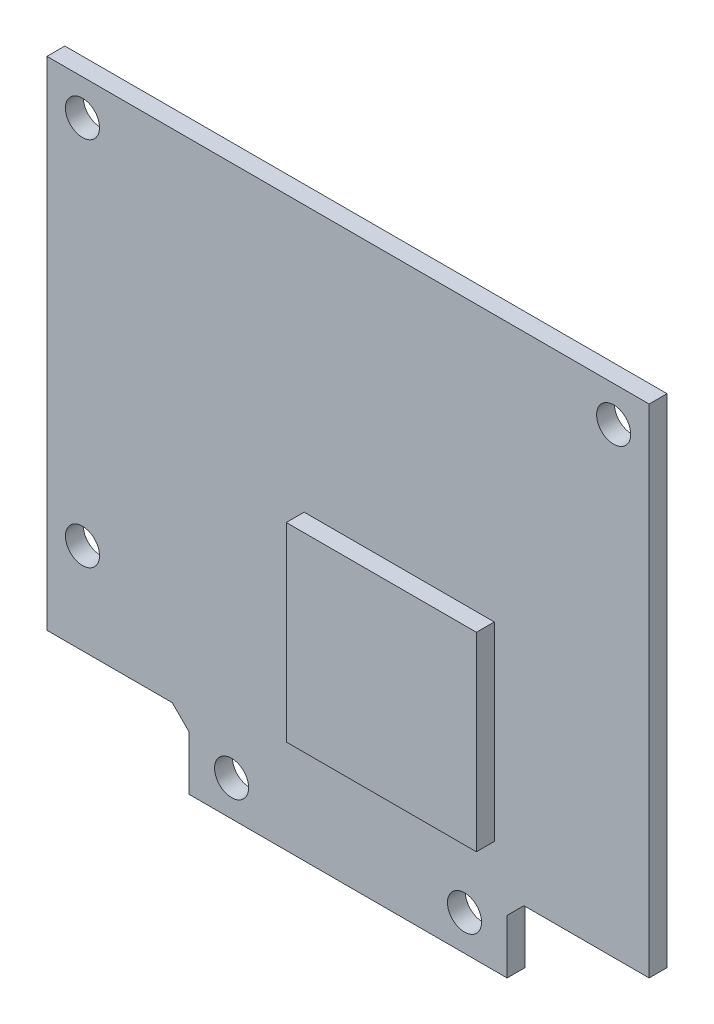
ISO-10303-21;
HEADER;
FILE_DESCRIPTION(('STEP AP214'),'2;1');
FILE_NAME('part.step','',(''),(''),'','','');
FILE_SCHEMA(('AUTOMOTIVE_DESIGN { 1 0 10303 214 1 1 1 1 }'));
ENDSEC;
DATA;
#1=APPLICATION_CONTEXT('core data for automotive mechanical design processes');
#2=APPLICATION_PROTOCOL_DEFINITION('international standard','automotive_design',2000,#1);
#3=PRODUCT_CONTEXT('',#1,'mechanical');
#4=PRODUCT('Part','Part','',(#3));
#5=PRODUCT_RELATED_PRODUCT_CATEGORY('part','',(#4));
#6=PRODUCT_DEFINITION_FORMATION('','',#4);
#7=PRODUCT_DEFINITION_CONTEXT('part definition',#1,'design');
#8=PRODUCT_DEFINITION('design','',#6,#7);
#9=PRODUCT_DEFINITION_SHAPE('','',#8);
#10=(LENGTH_UNIT() NAMED_UNIT(*) SI_UNIT(.MILLI.,.METRE.));
#11=(NAMED_UNIT(*) PLANE_ANGLE_UNIT() SI_UNIT($,.RADIAN.));
#12=(NAMED_UNIT(*) SI_UNIT($,.STERADIAN.) SOLID_ANGLE_UNIT());
#13=UNCERTAINTY_MEASURE_WITH_UNIT(LENGTH_MEASURE(1.E-05),#10,'distance_accuracy_value','');
#14=(GEOMETRIC_REPRESENTATION_CONTEXT(3) GLOBAL_UNCERTAINTY_ASSIGNED_CONTEXT((#13)) GLOBAL_UNIT_ASSIGNED_CONTEXT((#10,
#11,#12)) REPRESENTATION_CONTEXT('',''));
#15=CARTESIAN_POINT('',(0.,0.,0.));
#16=DIRECTION('',(0.,0.,1.));
#17=DIRECTION('',(1.,0.,0.));
#18=AXIS2_PLACEMENT_3D('',#15,#16,#17);
#19=CARTESIAN_POINT('',(0.,0.,1.6));
#20=DIRECTION('',(0.,0.,1.));
#21=DIRECTION('',(1.,0.,0.));
#22=AXIS2_PLACEMENT_3D('',#19,#20,#21);
#23=PLANE('',#22);
#24=CARTESIAN_POINT('',(-23.749,7.365,1.6));
#25=DIRECTION('',(0.,0.,1.));
#26=DIRECTION('',(1.,0.,0.));
#27=AXIS2_PLACEMENT_3D('',#24,#25,#26);
#28=CIRCLE('',#27,1.524);
#29=CARTESIAN_POINT('',(-22.225,7.365,1.6));
#30=VERTEX_POINT('',#29);
#31=EDGE_CURVE('E166',#30,#30,#28,.T.);
#32=ORIENTED_EDGE('',*,*,#31,.F.);
#33=EDGE_LOOP('',(#32));
#34=FACE_BOUND('',#33,.T.);
#35=CARTESIAN_POINT('',(-10.414,-37.085,1.6));
#36=DIRECTION('',(0.,0.,1.));
#37=DIRECTION('',(1.,0.,0.));
#38=AXIS2_PLACEMENT_3D('',#35,#36,#37);
#39=CIRCLE('',#38,1.524);
#40=CARTESIAN_POINT('',(-8.88999999999999,-37.085,1.6));
#41=VERTEX_POINT('',#40);
#42=EDGE_CURVE('E180',#41,#41,#39,.T.);
#43=ORIENTED_EDGE('',*,*,#42,.F.);
#44=EDGE_LOOP('',(#43));
#45=FACE_BOUND('',#44,.T.);
#46=CARTESIAN_POINT('',(23.749,7.36500000000001,1.6));
#47=DIRECTION('',(0.,0.,1.));
#48=DIRECTION('',(1.,0.,0.));
#49=AXIS2_PLACEMENT_3D('',#46,#47,#48);
#50=CIRCLE('',#49,1.524);
#51=CARTESIAN_POINT('',(25.273,7.36500000000001,1.6));
#52=VERTEX_POINT('',#51);
#53=EDGE_CURVE('E192',#52,#52,#50,.T.);
#54=ORIENTED_EDGE('',*,*,#53,.F.);
#55=EDGE_LOOP('',(#54));
#56=FACE_BOUND('',#55,.T.);
#57=DIRECTION('',(0.,1.,0.));
#58=VECTOR('',#57,1.);
#59=CARTESIAN_POINT('',(14.224,-40.26,1.6));
#60=LINE('',#59,#58);
#61=CARTESIAN_POINT('',(14.224,-40.26,1.6));
#62=VERTEX_POINT('',#61);
#63=CARTESIAN_POINT('',(14.224,-35.41,1.6));
#64=VERTEX_POINT('',#63);
#65=EDGE_CURVE('E199',#62,#64,#60,.T.);
#66=ORIENTED_EDGE('',*,*,#65,.T.);
#67=DIRECTION('',(0.707106781186548,0.707106781186548,0.));
#68=VECTOR('',#67,1.);
#69=CARTESIAN_POINT('',(14.224,-35.41,1.6));
#70=LINE('',#69,#68);
#71=CARTESIAN_POINT('',(15.724,-33.91,1.6));
#72=VERTEX_POINT('',#71);
#73=EDGE_CURVE('E256',#64,#72,#70,.T.);
#74=ORIENTED_EDGE('',*,*,#73,.T.);
#75=DIRECTION('',(1.,0.,0.));
#76=VECTOR('',#75,1.);
#77=CARTESIAN_POINT('',(15.724,-33.91,1.6));
#78=LINE('',#77,#76);
#79=CARTESIAN_POINT('',(26.924,-33.91,1.6));
#80=VERTEX_POINT('',#79);
#81=EDGE_CURVE('E253',#72,#80,#78,.T.);
#82=ORIENTED_EDGE('',*,*,#81,.T.);
#83=DIRECTION('',(0.,1.,0.));
#84=VECTOR('',#83,1.);
#85=CARTESIAN_POINT('',(26.924,-33.91,1.6));
#86=LINE('',#85,#84);
#87=CARTESIAN_POINT('',(26.924,10.54,1.6));
#88=VERTEX_POINT('',#87);
#89=EDGE_CURVE('E250',#80,#88,#86,.T.);
#90=ORIENTED_EDGE('',*,*,#89,.T.);
#91=DIRECTION('',(-1.,0.,0.));
#92=VECTOR('',#91,1.);
#93=CARTESIAN_POINT('',(26.924,10.54,1.6));
#94=LINE('',#93,#92);
#95=CARTESIAN_POINT('',(-26.924,10.54,1.6));
#96=VERTEX_POINT('',#95);
#97=EDGE_CURVE('E247',#88,#96,#94,.T.);
#98=ORIENTED_EDGE('',*,*,#97,.T.);
#99=DIRECTION('',(0.,-1.,0.));
#100=VECTOR('',#99,1.);
#101=CARTESIAN_POINT('',(-26.924,10.54,1.6));
#102=LINE('',#101,#100);
#103=CARTESIAN_POINT('',(-26.924,-33.91,1.6));
#104=VERTEX_POINT('',#103);
#105=EDGE_CURVE('E244',#96,#104,#102,.T.);
#106=ORIENTED_EDGE('',*,*,#105,.T.);
#107=DIRECTION('',(1.,0.,0.));
#108=VECTOR('',#107,1.);
#109=CARTESIAN_POINT('',(-26.924,-33.91,1.6));
#110=LINE('',#109,#108);
#111=CARTESIAN_POINT('',(-15.724,-33.91,1.6));
#112=VERTEX_POINT('',#111);
#113=EDGE_CURVE('E241',#104,#112,#110,.T.);
#114=ORIENTED_EDGE('',*,*,#113,.T.);
#115=DIRECTION('',(0.707106781186546,-0.707106781186549,0.));
#116=VECTOR('',#115,1.);
#117=CARTESIAN_POINT('',(-15.724,-33.91,1.6));
#118=LINE('',#117,#116);
#119=CARTESIAN_POINT('',(-14.224,-35.41,1.6));
#120=VERTEX_POINT('',#119);
#121=EDGE_CURVE('E238',#112,#120,#118,.T.);
#122=ORIENTED_EDGE('',*,*,#121,.T.);
#123=DIRECTION('',(0.,-1.,0.));
#124=VECTOR('',#123,1.);
#125=CARTESIAN_POINT('',(-14.224,-35.41,1.6));
#126=LINE('',#125,#124);
#127=CARTESIAN_POINT('',(-14.224,-40.26,1.6));
#128=VERTEX_POINT('',#127);
#129=EDGE_CURVE('E44',#120,#128,#126,.T.);
#130=ORIENTED_EDGE('',*,*,#129,.T.);
#131=DIRECTION('',(1.,0.,0.));
#132=VECTOR('',#131,1.);
#133=CARTESIAN_POINT('',(-14.224,-40.26,1.6));
#134=LINE('',#133,#132);
#135=EDGE_CURVE('E11',#128,#62,#134,.T.);
#136=ORIENTED_EDGE('',*,*,#135,.T.);
#137=EDGE_LOOP('',(#66,#74,#82,#90,#98,#106,#114,#122,#130,#136));
#138=FACE_BOUND('',#137,.T.);
#139=CARTESIAN_POINT('',(10.414,-37.085,1.6));
#140=DIRECTION('',(0.,0.,1.));
#141=DIRECTION('',(1.,0.,0.));
#142=AXIS2_PLACEMENT_3D('',#139,#140,#141);
#143=CIRCLE('',#142,1.524);
#144=CARTESIAN_POINT('',(11.938,-37.085,1.6));
#145=VERTEX_POINT('',#144);
#146=EDGE_CURVE('E186',#145,#145,#143,.T.);
#147=ORIENTED_EDGE('',*,*,#146,.F.);
#148=EDGE_LOOP('',(#147));
#149=FACE_BOUND('',#148,.T.);
#150=CARTESIAN_POINT('',(-23.749,-25.782,1.6));
#151=DIRECTION('',(0.,0.,1.));
#152=DIRECTION('',(1.,0.,0.));
#153=AXIS2_PLACEMENT_3D('',#150,#151,#152);
#154=CIRCLE('',#153,1.524);
#155=CARTESIAN_POINT('',(-22.225,-25.782,1.6));
#156=VERTEX_POINT('',#155);
#157=EDGE_CURVE('E174',#156,#156,#154,.T.);
#158=ORIENTED_EDGE('',*,*,#157,.F.);
#159=EDGE_LOOP('',(#158));
#160=FACE_BOUND('',#159,.T.);
#161=DIRECTION('',(1.,0.,0.));
#162=VECTOR('',#161,1.);
#163=CARTESIAN_POINT('',(-3.924,-30.26,1.6));
#164=LINE('',#163,#162);
#165=CARTESIAN_POINT('',(-3.924,-30.26,1.6));
#166=VERTEX_POINT('',#165);
#167=CARTESIAN_POINT('',(13.076,-30.26,1.6));
#168=VERTEX_POINT('',#167);
#169=EDGE_CURVE('E482',#166,#168,#164,.T.);
#170=ORIENTED_EDGE('',*,*,#169,.F.);
#171=DIRECTION('',(0.,-1.,0.));
#172=VECTOR('',#171,1.);
#173=CARTESIAN_POINT('',(-3.924,-13.26,1.6));
#174=LINE('',#173,#172);
#175=CARTESIAN_POINT('',(-3.924,-13.26,1.6));
#176=VERTEX_POINT('',#175);
#177=EDGE_CURVE('E161',#176,#166,#174,.T.);
#178=ORIENTED_EDGE('',*,*,#177,.F.);
#179=DIRECTION('',(-1.,0.,0.));
#180=VECTOR('',#179,1.);
#181=CARTESIAN_POINT('',(-3.924,-13.26,1.6));
#182=LINE('',#181,#180);
#183=CARTESIAN_POINT('',(13.076,-13.26,1.6));
#184=VERTEX_POINT('',#183);
#185=EDGE_CURVE('E157',#184,#176,#182,.T.);
#186=ORIENTED_EDGE('',*,*,#185,.F.);
#187=DIRECTION('',(0.,1.,0.));
#188=VECTOR('',#187,1.);
#189=CARTESIAN_POINT('',(13.076,-13.26,1.6));
#190=LINE('',#189,#188);
#191=EDGE_CURVE('E479',#168,#184,#190,.T.);
#192=ORIENTED_EDGE('',*,*,#191,.F.);
#193=EDGE_LOOP('',(#170,#178,#186,#192));
#194=FACE_BOUND('',#193,.T.);
#195=ADVANCED_FACE('F36',(#34,#45,#56,#138,#149,#160,#194),#23,.T.);
#196=CARTESIAN_POINT('',(0.,0.,0.));
#197=DIRECTION('',(0.,0.,-1.));
#198=DIRECTION('',(-1.,0.,0.));
#199=AXIS2_PLACEMENT_3D('',#196,#197,#198);
#200=PLANE('',#199);
#201=CARTESIAN_POINT('',(-23.749,-25.782,0.));
#202=DIRECTION('',(0.,0.,1.));
#203=DIRECTION('',(1.,0.,0.));
#204=AXIS2_PLACEMENT_3D('',#201,#202,#203);
#205=CIRCLE('',#204,1.524);
#206=CARTESIAN_POINT('',(-22.225,-25.782,0.));
#207=VERTEX_POINT('',#206);
#208=EDGE_CURVE('E172',#207,#207,#205,.T.);
#209=ORIENTED_EDGE('',*,*,#208,.T.);
#210=EDGE_LOOP('',(#209));
#211=FACE_BOUND('',#210,.T.);
#212=CARTESIAN_POINT('',(10.414,-37.085,0.));
#213=DIRECTION('',(0.,0.,1.));
#214=DIRECTION('',(1.,0.,0.));
#215=AXIS2_PLACEMENT_3D('',#212,#213,#214);
#216=CIRCLE('',#215,1.524);
#217=CARTESIAN_POINT('',(11.938,-37.085,0.));
#218=VERTEX_POINT('',#217);
#219=EDGE_CURVE('E183',#218,#218,#216,.T.);
#220=ORIENTED_EDGE('',*,*,#219,.T.);
#221=EDGE_LOOP('',(#220));
#222=FACE_BOUND('',#221,.T.);
#223=DIRECTION('',(0.707106781186547,0.707106781186547,0.));
#224=VECTOR('',#223,1.);
#225=CARTESIAN_POINT('',(14.224,-35.41,0.));
#226=LINE('',#225,#224);
#227=CARTESIAN_POINT('',(14.224,-35.41,0.));
#228=VERTEX_POINT('',#227);
#229=CARTESIAN_POINT('',(15.724,-33.91,0.));
#230=VERTEX_POINT('',#229);
#231=EDGE_CURVE('E233',#228,#230,#226,.T.);
#232=ORIENTED_EDGE('',*,*,#231,.F.);
#233=DIRECTION('',(0.,1.,0.));
#234=VECTOR('',#233,1.);
#235=CARTESIAN_POINT('',(14.224,-40.26,0.));
#236=LINE('',#235,#234);
#237=CARTESIAN_POINT('',(14.224,-40.26,0.));
#238=VERTEX_POINT('',#237);
#239=EDGE_CURVE('E197',#238,#228,#236,.T.);
#240=ORIENTED_EDGE('',*,*,#239,.F.);
#241=DIRECTION('',(1.,0.,0.));
#242=VECTOR('',#241,1.);
#243=CARTESIAN_POINT('',(-14.224,-40.26,0.));
#244=LINE('',#243,#242);
#245=CARTESIAN_POINT('',(-14.224,-40.26,0.));
#246=VERTEX_POINT('',#245);
#247=EDGE_CURVE('E201',#246,#238,#244,.T.);
#248=ORIENTED_EDGE('',*,*,#247,.F.);
#249=DIRECTION('',(0.,-1.,0.));
#250=VECTOR('',#249,1.);
#251=CARTESIAN_POINT('',(-14.224,-35.41,0.));
#252=LINE('',#251,#250);
#253=CARTESIAN_POINT('',(-14.224,-35.41,0.));
#254=VERTEX_POINT('',#253);
#255=EDGE_CURVE('E205',#254,#246,#252,.T.);
#256=ORIENTED_EDGE('',*,*,#255,.F.);
#257=DIRECTION('',(0.707106781186546,-0.707106781186549,0.));
#258=VECTOR('',#257,1.);
#259=CARTESIAN_POINT('',(-15.724,-33.91,0.));
#260=LINE('',#259,#258);
#261=CARTESIAN_POINT('',(-15.724,-33.91,0.));
#262=VERTEX_POINT('',#261);
#263=EDGE_CURVE('E209',#262,#254,#260,.T.);
#264=ORIENTED_EDGE('',*,*,#263,.F.);
#265=DIRECTION('',(1.,0.,0.));
#266=VECTOR('',#265,1.);
#267=CARTESIAN_POINT('',(-26.924,-33.91,0.));
#268=LINE('',#267,#266);
#269=CARTESIAN_POINT('',(-26.924,-33.91,0.));
#270=VERTEX_POINT('',#269);
#271=EDGE_CURVE('E213',#270,#262,#268,.T.);
#272=ORIENTED_EDGE('',*,*,#271,.F.);
#273=DIRECTION('',(0.,-1.,0.));
#274=VECTOR('',#273,1.);
#275=CARTESIAN_POINT('',(-26.924,10.54,0.));
#276=LINE('',#275,#274);
#277=CARTESIAN_POINT('',(-26.924,10.54,0.));
#278=VERTEX_POINT('',#277);
#279=EDGE_CURVE('E217',#278,#270,#276,.T.);
#280=ORIENTED_EDGE('',*,*,#279,.F.);
#281=DIRECTION('',(-1.,0.,0.));
#282=VECTOR('',#281,1.);
#283=CARTESIAN_POINT('',(26.924,10.54,0.));
#284=LINE('',#283,#282);
#285=CARTESIAN_POINT('',(26.924,10.54,0.));
#286=VERTEX_POINT('',#285);
#287=EDGE_CURVE('E221',#286,#278,#284,.T.);
#288=ORIENTED_EDGE('',*,*,#287,.F.);
#289=DIRECTION('',(0.,1.,0.));
#290=VECTOR('',#289,1.);
#291=CARTESIAN_POINT('',(26.924,-33.91,0.));
#292=LINE('',#291,#290);
#293=CARTESIAN_POINT('',(26.924,-33.91,0.));
#294=VERTEX_POINT('',#293);
#295=EDGE_CURVE('E225',#294,#286,#292,.T.);
#296=ORIENTED_EDGE('',*,*,#295,.F.);
#297=DIRECTION('',(1.,0.,0.));
#298=VECTOR('',#297,1.);
#299=CARTESIAN_POINT('',(15.724,-33.91,0.));
#300=LINE('',#299,#298);
#301=EDGE_CURVE('E229',#230,#294,#300,.T.);
#302=ORIENTED_EDGE('',*,*,#301,.F.);
#303=EDGE_LOOP('',(#232,#240,#248,#256,#264,#272,#280,#288,#296,#302));
#304=FACE_BOUND('',#303,.T.);
#305=CARTESIAN_POINT('',(23.749,7.36500000000001,0.));
#306=DIRECTION('',(0.,0.,1.));
#307=DIRECTION('',(1.,0.,0.));
#308=AXIS2_PLACEMENT_3D('',#305,#306,#307);
#309=CIRCLE('',#308,1.524);
#310=CARTESIAN_POINT('',(25.273,7.36500000000001,0.));
#311=VERTEX_POINT('',#310);
#312=EDGE_CURVE('E189',#311,#311,#309,.T.);
#313=ORIENTED_EDGE('',*,*,#312,.T.);
#314=EDGE_LOOP('',(#313));
#315=FACE_BOUND('',#314,.T.);
#316=CARTESIAN_POINT('',(-10.414,-37.085,0.));
#317=DIRECTION('',(0.,0.,1.));
#318=DIRECTION('',(1.,0.,0.));
#319=AXIS2_PLACEMENT_3D('',#316,#317,#318);
#320=CIRCLE('',#319,1.524);
#321=CARTESIAN_POINT('',(-8.88999999999999,-37.085,0.));
#322=VERTEX_POINT('',#321);
#323=EDGE_CURVE('E177',#322,#322,#320,.T.);
#324=ORIENTED_EDGE('',*,*,#323,.T.);
#325=EDGE_LOOP('',(#324));
#326=FACE_BOUND('',#325,.T.);
#327=CARTESIAN_POINT('',(-23.749,7.365,0.));
#328=DIRECTION('',(0.,0.,1.));
#329=DIRECTION('',(1.,0.,0.));
#330=AXIS2_PLACEMENT_3D('',#327,#328,#329);
#331=CIRCLE('',#330,1.524);
#332=CARTESIAN_POINT('',(-22.225,7.365,0.));
#333=VERTEX_POINT('',#332);
#334=EDGE_CURVE('E163',#333,#333,#331,.T.);
#335=ORIENTED_EDGE('',*,*,#334,.T.);
#336=EDGE_LOOP('',(#335));
#337=FACE_BOUND('',#336,.T.);
#338=ADVANCED_FACE('F277',(#211,#222,#304,#315,#326,#337),#200,.T.);
#339=CARTESIAN_POINT('',(14.224,-35.41,75.6286910866321));
#340=DIRECTION('',(-0.707106781186548,0.707106781186548,0.));
#341=DIRECTION('',(-0.707106781186548,-0.707106781186548,0.));
#342=AXIS2_PLACEMENT_3D('',#339,#340,#341);
#343=PLANE('',#342);
#344=ORIENTED_EDGE('',*,*,#73,.F.);
#345=DIRECTION('',(0.,0.,-1.));
#346=VECTOR('',#345,1.);
#347=CARTESIAN_POINT('',(14.224,-35.41,75.6286910866321));
#348=LINE('',#347,#346);
#349=EDGE_CURVE('E39',#64,#228,#348,.T.);
#350=ORIENTED_EDGE('',*,*,#349,.T.);
#351=ORIENTED_EDGE('',*,*,#231,.T.);
#352=DIRECTION('',(0.,0.,-1.));
#353=VECTOR('',#352,1.);
#354=CARTESIAN_POINT('',(15.724,-33.91,75.6286910866321));
#355=LINE('',#354,#353);
#356=EDGE_CURVE('E232',#72,#230,#355,.T.);
#357=ORIENTED_EDGE('',*,*,#356,.F.);
#358=EDGE_LOOP('',(#344,#350,#351,#357));
#359=FACE_BOUND('',#358,.T.);
#360=ADVANCED_FACE('F283',(#359),#343,.F.);
#361=CARTESIAN_POINT('',(15.724,-33.91,75.6286910866321));
#362=DIRECTION('',(0.,1.,0.));
#363=DIRECTION('',(0.,0.,1.));
#364=AXIS2_PLACEMENT_3D('',#361,#362,#363);
#365=PLANE('',#364);
#366=ORIENTED_EDGE('',*,*,#81,.F.);
#367=ORIENTED_EDGE('',*,*,#356,.T.);
#368=ORIENTED_EDGE('',*,*,#301,.T.);
#369=DIRECTION('',(0.,0.,-1.));
#370=VECTOR('',#369,1.);
#371=CARTESIAN_POINT('',(26.924,-33.91,75.6286910866321));
#372=LINE('',#371,#370);
#373=EDGE_CURVE('E228',#80,#294,#372,.T.);
#374=ORIENTED_EDGE('',*,*,#373,.F.);
#375=EDGE_LOOP('',(#366,#367,#368,#374));
#376=FACE_BOUND('',#375,.T.);
#377=ADVANCED_FACE('F309',(#376),#365,.F.);
#378=CARTESIAN_POINT('',(26.924,-33.91,75.6286910866321));
#379=DIRECTION('',(-1.,0.,0.));
#380=DIRECTION('',(0.,-1.,0.));
#381=AXIS2_PLACEMENT_3D('',#378,#379,#380);
#382=PLANE('',#381);
#383=ORIENTED_EDGE('',*,*,#89,.F.);
#384=ORIENTED_EDGE('',*,*,#373,.T.);
#385=ORIENTED_EDGE('',*,*,#295,.T.);
#386=DIRECTION('',(0.,0.,-1.));
#387=VECTOR('',#386,1.);
#388=CARTESIAN_POINT('',(26.924,10.54,75.6286910866321));
#389=LINE('',#388,#387);
#390=EDGE_CURVE('E224',#88,#286,#389,.T.);
#391=ORIENTED_EDGE('',*,*,#390,.F.);
#392=EDGE_LOOP('',(#383,#384,#385,#391));
#393=FACE_BOUND('',#392,.T.);
#394=ADVANCED_FACE('F306',(#393),#382,.F.);
#395=CARTESIAN_POINT('',(26.924,10.54,75.6286910866321));
#396=DIRECTION('',(0.,-1.,0.));
#397=DIRECTION('',(1.,0.,0.));
#398=AXIS2_PLACEMENT_3D('',#395,#396,#397);
#399=PLANE('',#398);
#400=ORIENTED_EDGE('',*,*,#97,.F.);
#401=ORIENTED_EDGE('',*,*,#390,.T.);
#402=ORIENTED_EDGE('',*,*,#287,.T.);
#403=DIRECTION('',(0.,0.,-1.));
#404=VECTOR('',#403,1.);
#405=CARTESIAN_POINT('',(-26.924,10.54,75.6286910866321));
#406=LINE('',#405,#404);
#407=EDGE_CURVE('E220',#96,#278,#406,.T.);
#408=ORIENTED_EDGE('',*,*,#407,.F.);
#409=EDGE_LOOP('',(#400,#401,#402,#408));
#410=FACE_BOUND('',#409,.T.);
#411=ADVANCED_FACE('F303',(#410),#399,.F.);
#412=CARTESIAN_POINT('',(-26.924,10.54,75.6286910866321));
#413=DIRECTION('',(1.,0.,0.));
#414=DIRECTION('',(0.,1.,0.));
#415=AXIS2_PLACEMENT_3D('',#412,#413,#414);
#416=PLANE('',#415);
#417=ORIENTED_EDGE('',*,*,#105,.F.);
#418=ORIENTED_EDGE('',*,*,#407,.T.);
#419=ORIENTED_EDGE('',*,*,#279,.T.);
#420=DIRECTION('',(0.,0.,-1.));
#421=VECTOR('',#420,1.);
#422=CARTESIAN_POINT('',(-26.924,-33.91,75.6286910866321));
#423=LINE('',#422,#421);
#424=EDGE_CURVE('E216',#104,#270,#423,.T.);
#425=ORIENTED_EDGE('',*,*,#424,.F.);
#426=EDGE_LOOP('',(#417,#418,#419,#425));
#427=FACE_BOUND('',#426,.T.);
#428=ADVANCED_FACE('F299',(#427),#416,.F.);
#429=CARTESIAN_POINT('',(-26.924,-33.91,75.6286910866321));
#430=DIRECTION('',(0.,1.,0.));
#431=DIRECTION('',(-1.,0.,0.));
#432=AXIS2_PLACEMENT_3D('',#429,#430,#431);
#433=PLANE('',#432);
#434=ORIENTED_EDGE('',*,*,#113,.F.);
#435=ORIENTED_EDGE('',*,*,#424,.T.);
#436=ORIENTED_EDGE('',*,*,#271,.T.);
#437=DIRECTION('',(0.,0.,-1.));
#438=VECTOR('',#437,1.);
#439=CARTESIAN_POINT('',(-15.724,-33.91,75.6286910866321));
#440=LINE('',#439,#438);
#441=EDGE_CURVE('E212',#112,#262,#440,.T.);
#442=ORIENTED_EDGE('',*,*,#441,.F.);
#443=EDGE_LOOP('',(#434,#435,#436,#442));
#444=FACE_BOUND('',#443,.T.);
#445=ADVANCED_FACE('F296',(#444),#433,.F.);
#446=CARTESIAN_POINT('',(-15.724,-33.91,75.6286910866321));
#447=DIRECTION('',(0.707106781186549,0.707106781186546,0.));
#448=DIRECTION('',(-0.707106781186546,0.707106781186549,0.));
#449=AXIS2_PLACEMENT_3D('',#446,#447,#448);
#450=PLANE('',#449);
#451=ORIENTED_EDGE('',*,*,#121,.F.);
#452=ORIENTED_EDGE('',*,*,#441,.T.);
#453=ORIENTED_EDGE('',*,*,#263,.T.);
#454=DIRECTION('',(0.,0.,-1.));
#455=VECTOR('',#454,1.);
#456=CARTESIAN_POINT('',(-14.224,-35.41,75.6286910866321));
#457=LINE('',#456,#455);
#458=EDGE_CURVE('E208',#120,#254,#457,.T.);
#459=ORIENTED_EDGE('',*,*,#458,.F.);
#460=EDGE_LOOP('',(#451,#452,#453,#459));
#461=FACE_BOUND('',#460,.T.);
#462=ADVANCED_FACE('F293',(#461),#450,.F.);
#463=CARTESIAN_POINT('',(-14.224,-35.41,75.6286910866321));
#464=DIRECTION('',(1.,0.,0.));
#465=DIRECTION('',(0.,0.,-1.));
#466=AXIS2_PLACEMENT_3D('',#463,#464,#465);
#467=PLANE('',#466);
#468=ORIENTED_EDGE('',*,*,#129,.F.);
#469=ORIENTED_EDGE('',*,*,#458,.T.);
#470=ORIENTED_EDGE('',*,*,#255,.T.);
#471=DIRECTION('',(0.,0.,-1.));
#472=VECTOR('',#471,1.);
#473=CARTESIAN_POINT('',(-14.224,-40.26,75.6286910866321));
#474=LINE('',#473,#472);
#475=EDGE_CURVE('E204',#128,#246,#474,.T.);
#476=ORIENTED_EDGE('',*,*,#475,.F.);
#477=EDGE_LOOP('',(#468,#469,#470,#476));
#478=FACE_BOUND('',#477,.T.);
#479=ADVANCED_FACE('F287',(#478),#467,.F.);
#480=CARTESIAN_POINT('',(-14.224,-40.26,75.6286910866321));
#481=DIRECTION('',(0.,1.,0.));
#482=DIRECTION('',(-1.,0.,0.));
#483=AXIS2_PLACEMENT_3D('',#480,#481,#482);
#484=PLANE('',#483);
#485=ORIENTED_EDGE('',*,*,#135,.F.);
#486=ORIENTED_EDGE('',*,*,#475,.T.);
#487=ORIENTED_EDGE('',*,*,#247,.T.);
#488=DIRECTION('',(0.,0.,-1.));
#489=VECTOR('',#488,1.);
#490=CARTESIAN_POINT('',(14.224,-40.26,75.6286910866321));
#491=LINE('',#490,#489);
#492=EDGE_CURVE('E200',#62,#238,#491,.T.);
#493=ORIENTED_EDGE('',*,*,#492,.F.);
#494=EDGE_LOOP('',(#485,#486,#487,#493));
#495=FACE_BOUND('',#494,.T.);
#496=ADVANCED_FACE('F273',(#495),#484,.F.);
#497=CARTESIAN_POINT('',(14.224,-40.26,75.6286910866321));
#498=DIRECTION('',(-1.,0.,0.));
#499=DIRECTION('',(0.,-1.,0.));
#500=AXIS2_PLACEMENT_3D('',#497,#498,#499);
#501=PLANE('',#500);
#502=ORIENTED_EDGE('',*,*,#65,.F.);
#503=ORIENTED_EDGE('',*,*,#492,.T.);
#504=ORIENTED_EDGE('',*,*,#239,.T.);
#505=ORIENTED_EDGE('',*,*,#349,.F.);
#506=EDGE_LOOP('',(#502,#503,#504,#505));
#507=FACE_BOUND('',#506,.T.);
#508=ADVANCED_FACE('F268',(#507),#501,.F.);
#509=CARTESIAN_POINT('',(23.749,7.36500000000001,1.6));
#510=DIRECTION('',(0.,0.,-1.));
#511=DIRECTION('',(-1.,0.,0.));
#512=AXIS2_PLACEMENT_3D('',#509,#510,#511);
#513=CYLINDRICAL_SURFACE('',#512,1.524);
#514=ORIENTED_EDGE('',*,*,#53,.T.);
#515=EDGE_LOOP('',(#514));
#516=FACE_BOUND('',#515,.T.);
#517=ORIENTED_EDGE('',*,*,#312,.F.);
#518=EDGE_LOOP('',(#517));
#519=FACE_BOUND('',#518,.T.);
#520=ADVANCED_FACE('F330',(#516,#519),#513,.F.);
#521=CARTESIAN_POINT('',(10.414,-37.085,1.6));
#522=DIRECTION('',(0.,0.,-1.));
#523=DIRECTION('',(-1.,0.,0.));
#524=AXIS2_PLACEMENT_3D('',#521,#522,#523);
#525=CYLINDRICAL_SURFACE('',#524,1.524);
#526=ORIENTED_EDGE('',*,*,#146,.T.);
#527=EDGE_LOOP('',(#526));
#528=FACE_BOUND('',#527,.T.);
#529=ORIENTED_EDGE('',*,*,#219,.F.);
#530=EDGE_LOOP('',(#529));
#531=FACE_BOUND('',#530,.T.);
#532=ADVANCED_FACE('F333',(#528,#531),#525,.F.);
#533=CARTESIAN_POINT('',(-10.414,-37.085,1.6));
#534=DIRECTION('',(0.,0.,-1.));
#535=DIRECTION('',(-1.,0.,0.));
#536=AXIS2_PLACEMENT_3D('',#533,#534,#535);
#537=CYLINDRICAL_SURFACE('',#536,1.524);
#538=ORIENTED_EDGE('',*,*,#42,.T.);
#539=EDGE_LOOP('',(#538));
#540=FACE_BOUND('',#539,.T.);
#541=ORIENTED_EDGE('',*,*,#323,.F.);
#542=EDGE_LOOP('',(#541));
#543=FACE_BOUND('',#542,.T.);
#544=ADVANCED_FACE('F351',(#540,#543),#537,.F.);
#545=CARTESIAN_POINT('',(-23.749,-25.782,1.6));
#546=DIRECTION('',(0.,0.,-1.));
#547=DIRECTION('',(-1.,0.,0.));
#548=AXIS2_PLACEMENT_3D('',#545,#546,#547);
#549=CYLINDRICAL_SURFACE('',#548,1.524);
#550=ORIENTED_EDGE('',*,*,#157,.T.);
#551=EDGE_LOOP('',(#550));
#552=FACE_BOUND('',#551,.T.);
#553=ORIENTED_EDGE('',*,*,#208,.F.);
#554=EDGE_LOOP('',(#553));
#555=FACE_BOUND('',#554,.T.);
#556=ADVANCED_FACE('F343',(#552,#555),#549,.F.);
#557=CARTESIAN_POINT('',(-23.749,7.365,1.6));
#558=DIRECTION('',(0.,0.,-1.));
#559=DIRECTION('',(-1.,0.,0.));
#560=AXIS2_PLACEMENT_3D('',#557,#558,#559);
#561=CYLINDRICAL_SURFACE('',#560,1.524);
#562=ORIENTED_EDGE('',*,*,#31,.T.);
#563=EDGE_LOOP('',(#562));
#564=FACE_BOUND('',#563,.T.);
#565=ORIENTED_EDGE('',*,*,#334,.F.);
#566=EDGE_LOOP('',(#565));
#567=FACE_BOUND('',#566,.T.);
#568=ADVANCED_FACE('F341',(#564,#567),#561,.F.);
#569=CARTESIAN_POINT('',(-3.924,-13.26,3.2));
#570=DIRECTION('',(1.,0.,0.));
#571=DIRECTION('',(0.,1.,0.));
#572=AXIS2_PLACEMENT_3D('',#569,#570,#571);
#573=PLANE('',#572);
#574=ORIENTED_EDGE('',*,*,#177,.T.);
#575=DIRECTION('',(0.,0.,-1.));
#576=VECTOR('',#575,1.);
#577=CARTESIAN_POINT('',(-3.924,-30.26,3.2));
#578=LINE('',#577,#576);
#579=CARTESIAN_POINT('',(-3.924,-30.26,3.2));
#580=VERTEX_POINT('',#579);
#581=EDGE_CURVE('E142',#580,#166,#578,.T.);
#582=ORIENTED_EDGE('',*,*,#581,.F.);
#583=DIRECTION('',(0.,-1.,0.));
#584=VECTOR('',#583,1.);
#585=CARTESIAN_POINT('',(-3.924,-13.26,3.2));
#586=LINE('',#585,#584);
#587=CARTESIAN_POINT('',(-3.924,-13.26,3.2));
#588=VERTEX_POINT('',#587);
#589=EDGE_CURVE('E149',#588,#580,#586,.T.);
#590=ORIENTED_EDGE('',*,*,#589,.F.);
#591=DIRECTION('',(0.,0.,-1.));
#592=VECTOR('',#591,1.);
#593=CARTESIAN_POINT('',(-3.924,-13.26,3.2));
#594=LINE('',#593,#592);
#595=EDGE_CURVE('E476',#588,#176,#594,.T.);
#596=ORIENTED_EDGE('',*,*,#595,.T.);
#597=EDGE_LOOP('',(#574,#582,#590,#596));
#598=FACE_BOUND('',#597,.T.);
#599=ADVANCED_FACE('F159',(#598),#573,.F.);
#600=CARTESIAN_POINT('',(-3.924,-30.26,3.2));
#601=DIRECTION('',(0.,1.,0.));
#602=DIRECTION('',(-1.,0.,0.));
#603=AXIS2_PLACEMENT_3D('',#600,#601,#602);
#604=PLANE('',#603);
#605=ORIENTED_EDGE('',*,*,#169,.T.);
#606=DIRECTION('',(0.,0.,-1.));
#607=VECTOR('',#606,1.);
#608=CARTESIAN_POINT('',(13.076,-30.26,3.2));
#609=LINE('',#608,#607);
#610=CARTESIAN_POINT('',(13.076,-30.26,3.2));
#611=VERTEX_POINT('',#610);
#612=EDGE_CURVE('E145',#611,#168,#609,.T.);
#613=ORIENTED_EDGE('',*,*,#612,.F.);
#614=DIRECTION('',(1.,0.,0.));
#615=VECTOR('',#614,1.);
#616=CARTESIAN_POINT('',(-3.924,-30.26,3.2));
#617=LINE('',#616,#615);
#618=EDGE_CURVE('E138',#580,#611,#617,.T.);
#619=ORIENTED_EDGE('',*,*,#618,.F.);
#620=ORIENTED_EDGE('',*,*,#581,.T.);
#621=EDGE_LOOP('',(#605,#613,#619,#620));
#622=FACE_BOUND('',#621,.T.);
#623=ADVANCED_FACE('F140',(#622),#604,.F.);
#624=CARTESIAN_POINT('',(13.076,-13.26,3.2));
#625=DIRECTION('',(-1.,0.,0.));
#626=DIRECTION('',(0.,-1.,0.));
#627=AXIS2_PLACEMENT_3D('',#624,#625,#626);
#628=PLANE('',#627);
#629=ORIENTED_EDGE('',*,*,#191,.T.);
#630=DIRECTION('',(0.,0.,-1.));
#631=VECTOR('',#630,1.);
#632=CARTESIAN_POINT('',(13.076,-13.26,3.2));
#633=LINE('',#632,#631);
#634=CARTESIAN_POINT('',(13.076,-13.26,3.2));
#635=VERTEX_POINT('',#634);
#636=EDGE_CURVE('E52',#635,#184,#633,.T.);
#637=ORIENTED_EDGE('',*,*,#636,.F.);
#638=DIRECTION('',(0.,1.,0.));
#639=VECTOR('',#638,1.);
#640=CARTESIAN_POINT('',(13.076,-13.26,3.2));
#641=LINE('',#640,#639);
#642=EDGE_CURVE('E148',#611,#635,#641,.T.);
#643=ORIENTED_EDGE('',*,*,#642,.F.);
#644=ORIENTED_EDGE('',*,*,#612,.T.);
#645=EDGE_LOOP('',(#629,#637,#643,#644));
#646=FACE_BOUND('',#645,.T.);
#647=ADVANCED_FACE('F446',(#646),#628,.F.);
#648=CARTESIAN_POINT('',(-3.924,-13.26,3.2));
#649=DIRECTION('',(0.,-1.,0.));
#650=DIRECTION('',(0.,0.,-1.));
#651=AXIS2_PLACEMENT_3D('',#648,#649,#650);
#652=PLANE('',#651);
#653=ORIENTED_EDGE('',*,*,#185,.T.);
#654=ORIENTED_EDGE('',*,*,#595,.F.);
#655=DIRECTION('',(-1.,0.,0.));
#656=VECTOR('',#655,1.);
#657=CARTESIAN_POINT('',(-3.924,-13.26,3.2));
#658=LINE('',#657,#656);
#659=EDGE_CURVE('E153',#635,#588,#658,.T.);
#660=ORIENTED_EDGE('',*,*,#659,.F.);
#661=ORIENTED_EDGE('',*,*,#636,.T.);
#662=EDGE_LOOP('',(#653,#654,#660,#661));
#663=FACE_BOUND('',#662,.T.);
#664=ADVANCED_FACE('F454',(#663),#652,.F.);
#665=CARTESIAN_POINT('',(0.,0.,3.2));
#666=DIRECTION('',(0.,0.,1.));
#667=DIRECTION('',(1.,0.,0.));
#668=AXIS2_PLACEMENT_3D('',#665,#666,#667);
#669=PLANE('',#668);
#670=ORIENTED_EDGE('',*,*,#589,.T.);
#671=ORIENTED_EDGE('',*,*,#618,.T.);
#672=ORIENTED_EDGE('',*,*,#642,.T.);
#673=ORIENTED_EDGE('',*,*,#659,.T.);
#674=EDGE_LOOP('',(#670,#671,#672,#673));
#675=FACE_BOUND('',#674,.T.);
#676=ADVANCED_FACE('F152',(#675),#669,.T.);
#677=CLOSED_SHELL('',(#195,#338,#360,#377,#394,#411,#428,#445,#462,#479,#496,#508,#520,#532,
#544,#556,#568,#599,#623,#647,#664,#676));
#678=MANIFOLD_SOLID_BREP('B2',#677);
#679=ADVANCED_BREP_SHAPE_REPRESENTATION('',(#18,#678),#14);
#680=SHAPE_DEFINITION_REPRESENTATION(#9,#679);
ENDSEC;
END-ISO-10303-21;
